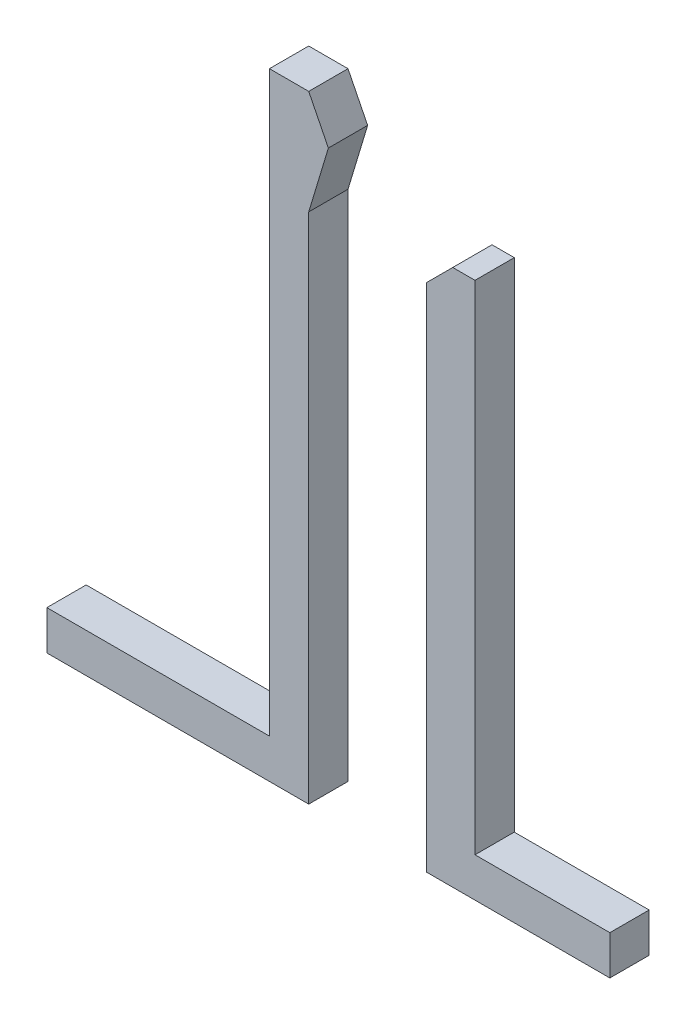
ISO-10303-21;
HEADER;
FILE_DESCRIPTION(('STEP AP214'),'2;1');
FILE_NAME('part.step','',(''),(''),'','','');
FILE_SCHEMA(('AUTOMOTIVE_DESIGN { 1 0 10303 214 1 1 1 1 }'));
ENDSEC;
DATA;
#1=APPLICATION_CONTEXT('core data for automotive mechanical design processes');
#2=APPLICATION_PROTOCOL_DEFINITION('international standard','automotive_design',2000,#1);
#3=PRODUCT_CONTEXT('',#1,'mechanical');
#4=PRODUCT('Part','Part','',(#3));
#5=PRODUCT_RELATED_PRODUCT_CATEGORY('part','',(#4));
#6=PRODUCT_DEFINITION_FORMATION('','',#4);
#7=PRODUCT_DEFINITION_CONTEXT('part definition',#1,'design');
#8=PRODUCT_DEFINITION('design','',#6,#7);
#9=PRODUCT_DEFINITION_SHAPE('','',#8);
#10=(LENGTH_UNIT() NAMED_UNIT(*) SI_UNIT(.MILLI.,.METRE.));
#11=(NAMED_UNIT(*) PLANE_ANGLE_UNIT() SI_UNIT($,.RADIAN.));
#12=(NAMED_UNIT(*) SI_UNIT($,.STERADIAN.) SOLID_ANGLE_UNIT());
#13=UNCERTAINTY_MEASURE_WITH_UNIT(LENGTH_MEASURE(1.E-05),#10,'distance_accuracy_value','');
#14=(GEOMETRIC_REPRESENTATION_CONTEXT(3) GLOBAL_UNCERTAINTY_ASSIGNED_CONTEXT((#13)) GLOBAL_UNIT_ASSIGNED_CONTEXT((#10,
#11,#12)) REPRESENTATION_CONTEXT('',''));
#15=CARTESIAN_POINT('',(0.,0.,0.));
#16=DIRECTION('',(0.,0.,1.));
#17=DIRECTION('',(1.,0.,0.));
#18=AXIS2_PLACEMENT_3D('',#15,#16,#17);
#19=CARTESIAN_POINT('',(1.95,0.2,0.3));
#20=DIRECTION('',(-1.,0.,0.));
#21=DIRECTION('',(0.,0.,1.));
#22=AXIS2_PLACEMENT_3D('',#19,#20,#21);
#23=PLANE('',#22);
#24=DIRECTION('',(0.,1.,0.));
#25=VECTOR('',#24,1.);
#26=CARTESIAN_POINT('',(1.95,0.2,0.));
#27=LINE('',#26,#25);
#28=CARTESIAN_POINT('',(1.95,-0.1,0.));
#29=VERTEX_POINT('',#28);
#30=CARTESIAN_POINT('',(1.95,0.2,0.));
#31=VERTEX_POINT('',#30);
#32=EDGE_CURVE('E132',#29,#31,#27,.T.);
#33=ORIENTED_EDGE('',*,*,#32,.T.);
#34=DIRECTION('',(0.,0.,-1.));
#35=VECTOR('',#34,1.);
#36=CARTESIAN_POINT('',(1.95,0.2,0.3));
#37=LINE('',#36,#35);
#38=CARTESIAN_POINT('',(1.95,0.2,0.3));
#39=VERTEX_POINT('',#38);
#40=EDGE_CURVE('E12',#39,#31,#37,.T.);
#41=ORIENTED_EDGE('',*,*,#40,.F.);
#42=DIRECTION('',(0.,1.,0.));
#43=VECTOR('',#42,1.);
#44=CARTESIAN_POINT('',(1.95,0.2,0.3));
#45=LINE('',#44,#43);
#46=CARTESIAN_POINT('',(1.95,-0.1,0.3));
#47=VERTEX_POINT('',#46);
#48=EDGE_CURVE('E144',#47,#39,#45,.T.);
#49=ORIENTED_EDGE('',*,*,#48,.F.);
#50=DIRECTION('',(0.,0.,-1.));
#51=VECTOR('',#50,1.);
#52=CARTESIAN_POINT('',(1.95,-0.1,0.3));
#53=LINE('',#52,#51);
#54=EDGE_CURVE('E128',#47,#29,#53,.T.);
#55=ORIENTED_EDGE('',*,*,#54,.T.);
#56=EDGE_LOOP('',(#33,#41,#49,#55));
#57=FACE_BOUND('',#56,.T.);
#58=ADVANCED_FACE('F42',(#57),#23,.F.);
#59=CARTESIAN_POINT('',(0.92,0.2,0.3));
#60=DIRECTION('',(0.,-1.,0.));
#61=DIRECTION('',(0.,0.,-1.));
#62=AXIS2_PLACEMENT_3D('',#59,#60,#61);
#63=PLANE('',#62);
#64=DIRECTION('',(-1.,0.,0.));
#65=VECTOR('',#64,1.);
#66=CARTESIAN_POINT('',(0.92,0.2,0.));
#67=LINE('',#66,#65);
#68=CARTESIAN_POINT('',(0.92,0.2,0.));
#69=VERTEX_POINT('',#68);
#70=EDGE_CURVE('E135',#31,#69,#67,.T.);
#71=ORIENTED_EDGE('',*,*,#70,.T.);
#72=DIRECTION('',(0.,0.,-1.));
#73=VECTOR('',#72,1.);
#74=CARTESIAN_POINT('',(0.92,0.2,0.3));
#75=LINE('',#74,#73);
#76=CARTESIAN_POINT('',(0.92,0.2,0.3));
#77=VERTEX_POINT('',#76);
#78=EDGE_CURVE('E50',#77,#69,#75,.T.);
#79=ORIENTED_EDGE('',*,*,#78,.F.);
#80=DIRECTION('',(-1.,0.,0.));
#81=VECTOR('',#80,1.);
#82=CARTESIAN_POINT('',(0.92,0.2,0.3));
#83=LINE('',#82,#81);
#84=EDGE_CURVE('E98',#39,#77,#83,.T.);
#85=ORIENTED_EDGE('',*,*,#84,.F.);
#86=ORIENTED_EDGE('',*,*,#40,.T.);
#87=EDGE_LOOP('',(#71,#79,#85,#86));
#88=FACE_BOUND('',#87,.T.);
#89=ADVANCED_FACE('F169',(#88),#63,.F.);
#90=CARTESIAN_POINT('',(0.92,4.,0.3));
#91=DIRECTION('',(-1.,0.,0.));
#92=DIRECTION('',(0.,-1.,0.));
#93=AXIS2_PLACEMENT_3D('',#90,#91,#92);
#94=PLANE('',#93);
#95=DIRECTION('',(0.,1.,0.));
#96=VECTOR('',#95,1.);
#97=CARTESIAN_POINT('',(0.92,4.,0.));
#98=LINE('',#97,#96);
#99=CARTESIAN_POINT('',(0.92,4.,0.));
#100=VERTEX_POINT('',#99);
#101=EDGE_CURVE('E137',#69,#100,#98,.T.);
#102=ORIENTED_EDGE('',*,*,#101,.T.);
#103=DIRECTION('',(0.,0.,-1.));
#104=VECTOR('',#103,1.);
#105=CARTESIAN_POINT('',(0.92,4.,0.3));
#106=LINE('',#105,#104);
#107=CARTESIAN_POINT('',(0.92,4.,0.3));
#108=VERTEX_POINT('',#107);
#109=EDGE_CURVE('E148',#108,#100,#106,.T.);
#110=ORIENTED_EDGE('',*,*,#109,.F.);
#111=DIRECTION('',(0.,1.,0.));
#112=VECTOR('',#111,1.);
#113=CARTESIAN_POINT('',(0.92,4.,0.3));
#114=LINE('',#113,#112);
#115=EDGE_CURVE('E156',#77,#108,#114,.T.);
#116=ORIENTED_EDGE('',*,*,#115,.F.);
#117=ORIENTED_EDGE('',*,*,#78,.T.);
#118=EDGE_LOOP('',(#102,#110,#116,#117));
#119=FACE_BOUND('',#118,.T.);
#120=ADVANCED_FACE('F154',(#119),#94,.F.);
#121=CARTESIAN_POINT('',(0.75,4.,0.3));
#122=DIRECTION('',(0.,-1.,0.));
#123=DIRECTION('',(0.,0.,-1.));
#124=AXIS2_PLACEMENT_3D('',#121,#122,#123);
#125=PLANE('',#124);
#126=DIRECTION('',(-1.,0.,0.));
#127=VECTOR('',#126,1.);
#128=CARTESIAN_POINT('',(0.75,4.,0.));
#129=LINE('',#128,#127);
#130=CARTESIAN_POINT('',(0.75,4.,0.));
#131=VERTEX_POINT('',#130);
#132=EDGE_CURVE('E139',#100,#131,#129,.T.);
#133=ORIENTED_EDGE('',*,*,#132,.T.);
#134=DIRECTION('',(0.,0.,-1.));
#135=VECTOR('',#134,1.);
#136=CARTESIAN_POINT('',(0.75,4.,0.3));
#137=LINE('',#136,#135);
#138=CARTESIAN_POINT('',(0.75,4.,0.3));
#139=VERTEX_POINT('',#138);
#140=EDGE_CURVE('E123',#139,#131,#137,.T.);
#141=ORIENTED_EDGE('',*,*,#140,.F.);
#142=DIRECTION('',(-1.,0.,0.));
#143=VECTOR('',#142,1.);
#144=CARTESIAN_POINT('',(0.75,4.,0.3));
#145=LINE('',#144,#143);
#146=EDGE_CURVE('E114',#108,#139,#145,.T.);
#147=ORIENTED_EDGE('',*,*,#146,.F.);
#148=ORIENTED_EDGE('',*,*,#109,.T.);
#149=EDGE_LOOP('',(#133,#141,#147,#148));
#150=FACE_BOUND('',#149,.T.);
#151=ADVANCED_FACE('F162',(#150),#125,.F.);
#152=CARTESIAN_POINT('',(0.55,3.8,0.3));
#153=DIRECTION('',(0.707106781186548,-0.707106781186547,0.));
#154=DIRECTION('',(0.707106781186547,0.707106781186548,0.));
#155=AXIS2_PLACEMENT_3D('',#152,#153,#154);
#156=PLANE('',#155);
#157=DIRECTION('',(-0.707106781186547,-0.707106781186548,0.));
#158=VECTOR('',#157,1.);
#159=CARTESIAN_POINT('',(0.55,3.8,0.));
#160=LINE('',#159,#158);
#161=CARTESIAN_POINT('',(0.55,3.8,0.));
#162=VERTEX_POINT('',#161);
#163=EDGE_CURVE('E122',#131,#162,#160,.T.);
#164=ORIENTED_EDGE('',*,*,#163,.T.);
#165=DIRECTION('',(0.,0.,-1.));
#166=VECTOR('',#165,1.);
#167=CARTESIAN_POINT('',(0.55,3.8,0.3));
#168=LINE('',#167,#166);
#169=CARTESIAN_POINT('',(0.55,3.8,0.3));
#170=VERTEX_POINT('',#169);
#171=EDGE_CURVE('E119',#170,#162,#168,.T.);
#172=ORIENTED_EDGE('',*,*,#171,.F.);
#173=DIRECTION('',(-0.707106781186547,-0.707106781186548,0.));
#174=VECTOR('',#173,1.);
#175=CARTESIAN_POINT('',(0.55,3.8,0.3));
#176=LINE('',#175,#174);
#177=EDGE_CURVE('E108',#139,#170,#176,.T.);
#178=ORIENTED_EDGE('',*,*,#177,.F.);
#179=ORIENTED_EDGE('',*,*,#140,.T.);
#180=EDGE_LOOP('',(#164,#172,#178,#179));
#181=FACE_BOUND('',#180,.T.);
#182=ADVANCED_FACE('F120',(#181),#156,.F.);
#183=CARTESIAN_POINT('',(0.55,-0.1,0.3));
#184=DIRECTION('',(1.,0.,0.));
#185=DIRECTION('',(0.,0.,-1.));
#186=AXIS2_PLACEMENT_3D('',#183,#184,#185);
#187=PLANE('',#186);
#188=DIRECTION('',(0.,-1.,0.));
#189=VECTOR('',#188,1.);
#190=CARTESIAN_POINT('',(0.55,-0.1,0.));
#191=LINE('',#190,#189);
#192=CARTESIAN_POINT('',(0.55,-0.1,0.));
#193=VERTEX_POINT('',#192);
#194=EDGE_CURVE('E84',#162,#193,#191,.T.);
#195=ORIENTED_EDGE('',*,*,#194,.T.);
#196=DIRECTION('',(0.,0.,-1.));
#197=VECTOR('',#196,1.);
#198=CARTESIAN_POINT('',(0.55,-0.1,0.3));
#199=LINE('',#198,#197);
#200=CARTESIAN_POINT('',(0.55,-0.1,0.3));
#201=VERTEX_POINT('',#200);
#202=EDGE_CURVE('E124',#201,#193,#199,.T.);
#203=ORIENTED_EDGE('',*,*,#202,.F.);
#204=DIRECTION('',(0.,-1.,0.));
#205=VECTOR('',#204,1.);
#206=CARTESIAN_POINT('',(0.55,-0.1,0.3));
#207=LINE('',#206,#205);
#208=EDGE_CURVE('E112',#170,#201,#207,.T.);
#209=ORIENTED_EDGE('',*,*,#208,.F.);
#210=ORIENTED_EDGE('',*,*,#171,.T.);
#211=EDGE_LOOP('',(#195,#203,#209,#210));
#212=FACE_BOUND('',#211,.T.);
#213=ADVANCED_FACE('F126',(#212),#187,.F.);
#214=CARTESIAN_POINT('',(1.95,-0.1,0.3));
#215=DIRECTION('',(0.,1.,0.));
#216=DIRECTION('',(-1.,0.,0.));
#217=AXIS2_PLACEMENT_3D('',#214,#215,#216);
#218=PLANE('',#217);
#219=DIRECTION('',(1.,0.,0.));
#220=VECTOR('',#219,1.);
#221=CARTESIAN_POINT('',(1.95,-0.1,0.));
#222=LINE('',#221,#220);
#223=EDGE_CURVE('E90',#193,#29,#222,.T.);
#224=ORIENTED_EDGE('',*,*,#223,.T.);
#225=ORIENTED_EDGE('',*,*,#54,.F.);
#226=DIRECTION('',(1.,0.,0.));
#227=VECTOR('',#226,1.);
#228=CARTESIAN_POINT('',(1.95,-0.1,0.3));
#229=LINE('',#228,#227);
#230=EDGE_CURVE('E58',#201,#47,#229,.T.);
#231=ORIENTED_EDGE('',*,*,#230,.F.);
#232=ORIENTED_EDGE('',*,*,#202,.T.);
#233=EDGE_LOOP('',(#224,#225,#231,#232));
#234=FACE_BOUND('',#233,.T.);
#235=ADVANCED_FACE('F183',(#234),#218,.F.);
#236=CARTESIAN_POINT('',(0.,0.,0.3));
#237=DIRECTION('',(0.,0.,-1.));
#238=DIRECTION('',(-1.,0.,0.));
#239=AXIS2_PLACEMENT_3D('',#236,#237,#238);
#240=PLANE('',#239);
#241=ORIENTED_EDGE('',*,*,#48,.T.);
#242=ORIENTED_EDGE('',*,*,#84,.T.);
#243=ORIENTED_EDGE('',*,*,#115,.T.);
#244=ORIENTED_EDGE('',*,*,#146,.T.);
#245=ORIENTED_EDGE('',*,*,#177,.T.);
#246=ORIENTED_EDGE('',*,*,#208,.T.);
#247=ORIENTED_EDGE('',*,*,#230,.T.);
#248=EDGE_LOOP('',(#241,#242,#243,#244,#245,#246,#247));
#249=FACE_BOUND('',#248,.T.);
#250=ADVANCED_FACE('F110',(#249),#240,.F.);
#251=CARTESIAN_POINT('',(0.,0.,0.));
#252=DIRECTION('',(0.,0.,-1.));
#253=DIRECTION('',(-1.,0.,0.));
#254=AXIS2_PLACEMENT_3D('',#251,#252,#253);
#255=PLANE('',#254);
#256=ORIENTED_EDGE('',*,*,#32,.F.);
#257=ORIENTED_EDGE('',*,*,#223,.F.);
#258=ORIENTED_EDGE('',*,*,#194,.F.);
#259=ORIENTED_EDGE('',*,*,#163,.F.);
#260=ORIENTED_EDGE('',*,*,#132,.F.);
#261=ORIENTED_EDGE('',*,*,#101,.F.);
#262=ORIENTED_EDGE('',*,*,#70,.F.);
#263=EDGE_LOOP('',(#256,#257,#258,#259,#260,#261,#262));
#264=FACE_BOUND('',#263,.T.);
#265=ADVANCED_FACE('F160',(#264),#255,.T.);
#266=CLOSED_SHELL('',(#58,#89,#120,#151,#182,#213,#235,#250,#265));
#267=MANIFOLD_SOLID_BREP('B2',#266);
#268=CARTESIAN_POINT('',(-2.35,0.2,0.3));
#269=DIRECTION('',(1.,0.,0.));
#270=DIRECTION('',(0.,0.,-1.));
#271=AXIS2_PLACEMENT_3D('',#268,#269,#270);
#272=PLANE('',#271);
#273=DIRECTION('',(0.,-1.,0.));
#274=VECTOR('',#273,1.);
#275=CARTESIAN_POINT('',(-2.35,0.2,0.));
#276=LINE('',#275,#274);
#277=CARTESIAN_POINT('',(-2.35,0.2,0.));
#278=VERTEX_POINT('',#277);
#279=CARTESIAN_POINT('',(-2.35,-0.1,0.));
#280=VERTEX_POINT('',#279);
#281=EDGE_CURVE('E339',#278,#280,#276,.T.);
#282=ORIENTED_EDGE('',*,*,#281,.T.);
#283=DIRECTION('',(0.,0.,-1.));
#284=VECTOR('',#283,1.);
#285=CARTESIAN_POINT('',(-2.35,-0.1,0.3));
#286=LINE('',#285,#284);
#287=CARTESIAN_POINT('',(-2.35,-0.1,0.3));
#288=VERTEX_POINT('',#287);
#289=EDGE_CURVE('E40',#288,#280,#286,.T.);
#290=ORIENTED_EDGE('',*,*,#289,.F.);
#291=DIRECTION('',(0.,-1.,0.));
#292=VECTOR('',#291,1.);
#293=CARTESIAN_POINT('',(-2.35,0.2,0.3));
#294=LINE('',#293,#292);
#295=CARTESIAN_POINT('',(-2.35,0.2,0.3));
#296=VERTEX_POINT('',#295);
#297=EDGE_CURVE('E353',#296,#288,#294,.T.);
#298=ORIENTED_EDGE('',*,*,#297,.F.);
#299=DIRECTION('',(0.,0.,-1.));
#300=VECTOR('',#299,1.);
#301=CARTESIAN_POINT('',(-2.35,0.2,0.3));
#302=LINE('',#301,#300);
#303=EDGE_CURVE('E335',#296,#278,#302,.T.);
#304=ORIENTED_EDGE('',*,*,#303,.T.);
#305=EDGE_LOOP('',(#282,#290,#298,#304));
#306=FACE_BOUND('',#305,.T.);
#307=ADVANCED_FACE('F243',(#306),#272,.F.);
#308=CARTESIAN_POINT('',(-2.35,-0.1,0.3));
#309=DIRECTION('',(0.,1.,0.));
#310=DIRECTION('',(0.,0.,1.));
#311=AXIS2_PLACEMENT_3D('',#308,#309,#310);
#312=PLANE('',#311);
#313=DIRECTION('',(1.,0.,0.));
#314=VECTOR('',#313,1.);
#315=CARTESIAN_POINT('',(-2.35,-0.1,0.));
#316=LINE('',#315,#314);
#317=CARTESIAN_POINT('',(-0.35,-0.1,0.));
#318=VERTEX_POINT('',#317);
#319=EDGE_CURVE('E342',#280,#318,#316,.T.);
#320=ORIENTED_EDGE('',*,*,#319,.T.);
#321=DIRECTION('',(0.,0.,-1.));
#322=VECTOR('',#321,1.);
#323=CARTESIAN_POINT('',(-0.35,-0.1,0.3));
#324=LINE('',#323,#322);
#325=CARTESIAN_POINT('',(-0.35,-0.1,0.3));
#326=VERTEX_POINT('',#325);
#327=EDGE_CURVE('E251',#326,#318,#324,.T.);
#328=ORIENTED_EDGE('',*,*,#327,.F.);
#329=DIRECTION('',(1.,0.,0.));
#330=VECTOR('',#329,1.);
#331=CARTESIAN_POINT('',(-2.35,-0.1,0.3));
#332=LINE('',#331,#330);
#333=EDGE_CURVE('E302',#288,#326,#332,.T.);
#334=ORIENTED_EDGE('',*,*,#333,.F.);
#335=ORIENTED_EDGE('',*,*,#289,.T.);
#336=EDGE_LOOP('',(#320,#328,#334,#335));
#337=FACE_BOUND('',#336,.T.);
#338=ADVANCED_FACE('F388',(#337),#312,.F.);
#339=CARTESIAN_POINT('',(-0.35,-0.1,0.3));
#340=DIRECTION('',(-1.,0.,0.));
#341=DIRECTION('',(0.,0.,1.));
#342=AXIS2_PLACEMENT_3D('',#339,#340,#341);
#343=PLANE('',#342);
#344=DIRECTION('',(0.,1.,0.));
#345=VECTOR('',#344,1.);
#346=CARTESIAN_POINT('',(-0.35,-0.1,0.));
#347=LINE('',#346,#345);
#348=CARTESIAN_POINT('',(-0.35,3.81740715259392,0.));
#349=VERTEX_POINT('',#348);
#350=EDGE_CURVE('E344',#318,#349,#347,.T.);
#351=ORIENTED_EDGE('',*,*,#350,.T.);
#352=DIRECTION('',(0.,0.,-1.));
#353=VECTOR('',#352,1.);
#354=CARTESIAN_POINT('',(-0.35,3.81740715259392,0.3));
#355=LINE('',#354,#353);
#356=CARTESIAN_POINT('',(-0.35,3.81740715259392,0.3));
#357=VERTEX_POINT('',#356);
#358=EDGE_CURVE('E360',#357,#349,#355,.T.);
#359=ORIENTED_EDGE('',*,*,#358,.F.);
#360=DIRECTION('',(0.,1.,0.));
#361=VECTOR('',#360,1.);
#362=CARTESIAN_POINT('',(-0.35,-0.1,0.3));
#363=LINE('',#362,#361);
#364=EDGE_CURVE('E368',#326,#357,#363,.T.);
#365=ORIENTED_EDGE('',*,*,#364,.F.);
#366=ORIENTED_EDGE('',*,*,#327,.T.);
#367=EDGE_LOOP('',(#351,#359,#365,#366));
#368=FACE_BOUND('',#367,.T.);
#369=ADVANCED_FACE('F366',(#368),#343,.F.);
#370=CARTESIAN_POINT('',(-0.2,4.31481667929813,0.3));
#371=DIRECTION('',(-0.957413602339711,0.288719923203956,0.));
#372=DIRECTION('',(-0.288719923203956,-0.957413602339711,0.));
#373=AXIS2_PLACEMENT_3D('',#370,#371,#372);
#374=PLANE('',#373);
#375=DIRECTION('',(0.288719923203956,0.957413602339711,0.));
#376=VECTOR('',#375,1.);
#377=CARTESIAN_POINT('',(-0.2,4.31481667929813,0.));
#378=LINE('',#377,#376);
#379=CARTESIAN_POINT('',(-0.2,4.31481667929813,0.));
#380=VERTEX_POINT('',#379);
#381=EDGE_CURVE('E346',#349,#380,#378,.T.);
#382=ORIENTED_EDGE('',*,*,#381,.T.);
#383=DIRECTION('',(0.,0.,-1.));
#384=VECTOR('',#383,1.);
#385=CARTESIAN_POINT('',(-0.2,4.31481667929813,0.3));
#386=LINE('',#385,#384);
#387=CARTESIAN_POINT('',(-0.2,4.31481667929813,0.3));
#388=VERTEX_POINT('',#387);
#389=EDGE_CURVE('E357',#388,#380,#386,.T.);
#390=ORIENTED_EDGE('',*,*,#389,.F.);
#391=DIRECTION('',(0.288719923203956,0.957413602339711,0.));
#392=VECTOR('',#391,1.);
#393=CARTESIAN_POINT('',(-0.2,4.31481667929813,0.3));
#394=LINE('',#393,#392);
#395=EDGE_CURVE('E380',#357,#388,#394,.T.);
#396=ORIENTED_EDGE('',*,*,#395,.F.);
#397=ORIENTED_EDGE('',*,*,#358,.T.);
#398=EDGE_LOOP('',(#382,#390,#396,#397));
#399=FACE_BOUND('',#398,.T.);
#400=ADVANCED_FACE('F376',(#399),#374,.F.);
#401=CARTESIAN_POINT('',(-0.35,4.61481667929813,0.3));
#402=DIRECTION('',(-0.894427190999916,-0.447213595499958,0.));
#403=DIRECTION('',(0.447213595499958,-0.894427190999916,0.));
#404=AXIS2_PLACEMENT_3D('',#401,#402,#403);
#405=PLANE('',#404);
#406=DIRECTION('',(-0.447213595499958,0.894427190999916,0.));
#407=VECTOR('',#406,1.);
#408=CARTESIAN_POINT('',(-0.35,4.61481667929813,0.));
#409=LINE('',#408,#407);
#410=CARTESIAN_POINT('',(-0.35,4.61481667929813,0.));
#411=VERTEX_POINT('',#410);
#412=EDGE_CURVE('E348',#380,#411,#409,.T.);
#413=ORIENTED_EDGE('',*,*,#412,.T.);
#414=DIRECTION('',(0.,0.,-1.));
#415=VECTOR('',#414,1.);
#416=CARTESIAN_POINT('',(-0.35,4.61481667929813,0.3));
#417=LINE('',#416,#415);
#418=CARTESIAN_POINT('',(-0.35,4.61481667929813,0.3));
#419=VERTEX_POINT('',#418);
#420=EDGE_CURVE('E330',#419,#411,#417,.T.);
#421=ORIENTED_EDGE('',*,*,#420,.F.);
#422=DIRECTION('',(-0.447213595499958,0.894427190999916,0.));
#423=VECTOR('',#422,1.);
#424=CARTESIAN_POINT('',(-0.35,4.61481667929813,0.3));
#425=LINE('',#424,#423);
#426=EDGE_CURVE('E321',#388,#419,#425,.T.);
#427=ORIENTED_EDGE('',*,*,#426,.F.);
#428=ORIENTED_EDGE('',*,*,#389,.T.);
#429=EDGE_LOOP('',(#413,#421,#427,#428));
#430=FACE_BOUND('',#429,.T.);
#431=ADVANCED_FACE('F379',(#430),#405,.F.);
#432=CARTESIAN_POINT('',(-0.35,4.61481667929813,0.3));
#433=DIRECTION('',(0.,-1.,0.));
#434=DIRECTION('',(0.,0.,-1.));
#435=AXIS2_PLACEMENT_3D('',#432,#433,#434);
#436=PLANE('',#435);
#437=DIRECTION('',(-1.,0.,0.));
#438=VECTOR('',#437,1.);
#439=CARTESIAN_POINT('',(-0.35,4.61481667929813,0.));
#440=LINE('',#439,#438);
#441=CARTESIAN_POINT('',(-0.65,4.61481667929813,0.));
#442=VERTEX_POINT('',#441);
#443=EDGE_CURVE('E329',#411,#442,#440,.T.);
#444=ORIENTED_EDGE('',*,*,#443,.T.);
#445=DIRECTION('',(0.,0.,-1.));
#446=VECTOR('',#445,1.);
#447=CARTESIAN_POINT('',(-0.65,4.61481667929813,0.3));
#448=LINE('',#447,#446);
#449=CARTESIAN_POINT('',(-0.65,4.61481667929813,0.3));
#450=VERTEX_POINT('',#449);
#451=EDGE_CURVE('E326',#450,#442,#448,.T.);
#452=ORIENTED_EDGE('',*,*,#451,.F.);
#453=DIRECTION('',(-1.,0.,0.));
#454=VECTOR('',#453,1.);
#455=CARTESIAN_POINT('',(-0.35,4.61481667929813,0.3));
#456=LINE('',#455,#454);
#457=EDGE_CURVE('E315',#419,#450,#456,.T.);
#458=ORIENTED_EDGE('',*,*,#457,.F.);
#459=ORIENTED_EDGE('',*,*,#420,.T.);
#460=EDGE_LOOP('',(#444,#452,#458,#459));
#461=FACE_BOUND('',#460,.T.);
#462=ADVANCED_FACE('F327',(#461),#436,.F.);
#463=CARTESIAN_POINT('',(-0.65,4.61481667929813,0.3));
#464=DIRECTION('',(1.,0.,0.));
#465=DIRECTION('',(0.,1.,0.));
#466=AXIS2_PLACEMENT_3D('',#463,#464,#465);
#467=PLANE('',#466);
#468=DIRECTION('',(0.,-1.,0.));
#469=VECTOR('',#468,1.);
#470=CARTESIAN_POINT('',(-0.65,4.61481667929813,0.));
#471=LINE('',#470,#469);
#472=CARTESIAN_POINT('',(-0.65,0.2,0.));
#473=VERTEX_POINT('',#472);
#474=EDGE_CURVE('E288',#442,#473,#471,.T.);
#475=ORIENTED_EDGE('',*,*,#474,.T.);
#476=DIRECTION('',(0.,0.,-1.));
#477=VECTOR('',#476,1.);
#478=CARTESIAN_POINT('',(-0.65,0.2,0.3));
#479=LINE('',#478,#477);
#480=CARTESIAN_POINT('',(-0.65,0.2,0.3));
#481=VERTEX_POINT('',#480);
#482=EDGE_CURVE('E331',#481,#473,#479,.T.);
#483=ORIENTED_EDGE('',*,*,#482,.F.);
#484=DIRECTION('',(0.,-1.,0.));
#485=VECTOR('',#484,1.);
#486=CARTESIAN_POINT('',(-0.65,4.61481667929813,0.3));
#487=LINE('',#486,#485);
#488=EDGE_CURVE('E319',#450,#481,#487,.T.);
#489=ORIENTED_EDGE('',*,*,#488,.F.);
#490=ORIENTED_EDGE('',*,*,#451,.T.);
#491=EDGE_LOOP('',(#475,#483,#489,#490));
#492=FACE_BOUND('',#491,.T.);
#493=ADVANCED_FACE('F333',(#492),#467,.F.);
#494=CARTESIAN_POINT('',(-0.65,0.2,0.3));
#495=DIRECTION('',(0.,-1.,0.));
#496=DIRECTION('',(1.,0.,0.));
#497=AXIS2_PLACEMENT_3D('',#494,#495,#496);
#498=PLANE('',#497);
#499=DIRECTION('',(-1.,0.,0.));
#500=VECTOR('',#499,1.);
#501=CARTESIAN_POINT('',(-0.65,0.2,0.));
#502=LINE('',#501,#500);
#503=EDGE_CURVE('E294',#473,#278,#502,.T.);
#504=ORIENTED_EDGE('',*,*,#503,.T.);
#505=ORIENTED_EDGE('',*,*,#303,.F.);
#506=DIRECTION('',(-1.,0.,0.));
#507=VECTOR('',#506,1.);
#508=CARTESIAN_POINT('',(-0.65,0.2,0.3));
#509=LINE('',#508,#507);
#510=EDGE_CURVE('E259',#481,#296,#509,.T.);
#511=ORIENTED_EDGE('',*,*,#510,.F.);
#512=ORIENTED_EDGE('',*,*,#482,.T.);
#513=EDGE_LOOP('',(#504,#505,#511,#512));
#514=FACE_BOUND('',#513,.T.);
#515=ADVANCED_FACE('F404',(#514),#498,.F.);
#516=CARTESIAN_POINT('',(0.,0.,0.3));
#517=DIRECTION('',(0.,0.,1.));
#518=DIRECTION('',(1.,0.,0.));
#519=AXIS2_PLACEMENT_3D('',#516,#517,#518);
#520=PLANE('',#519);
#521=ORIENTED_EDGE('',*,*,#297,.T.);
#522=ORIENTED_EDGE('',*,*,#333,.T.);
#523=ORIENTED_EDGE('',*,*,#364,.T.);
#524=ORIENTED_EDGE('',*,*,#395,.T.);
#525=ORIENTED_EDGE('',*,*,#426,.T.);
#526=ORIENTED_EDGE('',*,*,#457,.T.);
#527=ORIENTED_EDGE('',*,*,#488,.T.);
#528=ORIENTED_EDGE('',*,*,#510,.T.);
#529=EDGE_LOOP('',(#521,#522,#523,#524,#525,#526,#527,#528));
#530=FACE_BOUND('',#529,.T.);
#531=ADVANCED_FACE('F317',(#530),#520,.T.);
#532=CARTESIAN_POINT('',(0.,0.,0.));
#533=DIRECTION('',(0.,0.,1.));
#534=DIRECTION('',(1.,0.,0.));
#535=AXIS2_PLACEMENT_3D('',#532,#533,#534);
#536=PLANE('',#535);
#537=ORIENTED_EDGE('',*,*,#281,.F.);
#538=ORIENTED_EDGE('',*,*,#503,.F.);
#539=ORIENTED_EDGE('',*,*,#474,.F.);
#540=ORIENTED_EDGE('',*,*,#443,.F.);
#541=ORIENTED_EDGE('',*,*,#412,.F.);
#542=ORIENTED_EDGE('',*,*,#381,.F.);
#543=ORIENTED_EDGE('',*,*,#350,.F.);
#544=ORIENTED_EDGE('',*,*,#319,.F.);
#545=EDGE_LOOP('',(#537,#538,#539,#540,#541,#542,#543,#544));
#546=FACE_BOUND('',#545,.T.);
#547=ADVANCED_FACE('F372',(#546),#536,.F.);
#548=CLOSED_SHELL('',(#307,#338,#369,#400,#431,#462,#493,#515,#531,#547));
#549=MANIFOLD_SOLID_BREP('B6',#548);
#550=ADVANCED_BREP_SHAPE_REPRESENTATION('',(#18,#267,#549),#14);
#551=SHAPE_DEFINITION_REPRESENTATION(#9,#550);
ENDSEC;
END-ISO-10303-21;
